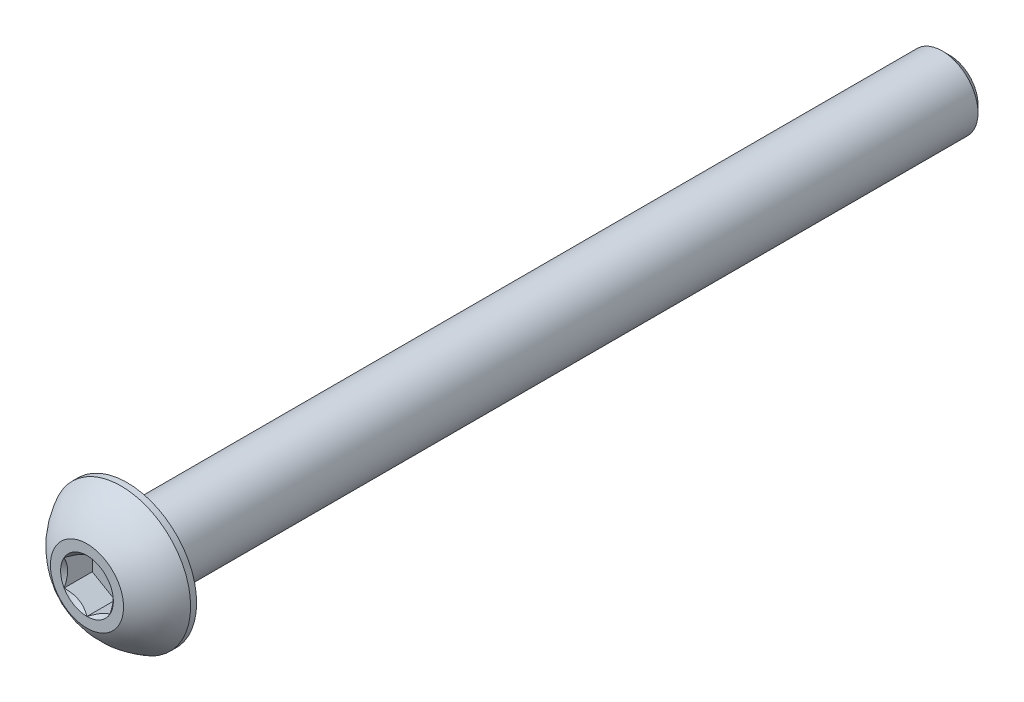
ISO-10303-21;
HEADER;
FILE_DESCRIPTION(('STEP AP214'),'2;1');
FILE_NAME('part.step','',(''),(''),'','','');
FILE_SCHEMA(('AUTOMOTIVE_DESIGN { 1 0 10303 214 1 1 1 1 }'));
ENDSEC;
DATA;
#1=APPLICATION_CONTEXT('core data for automotive mechanical design processes');
#2=APPLICATION_PROTOCOL_DEFINITION('international standard','automotive_design',2000,#1);
#3=PRODUCT_CONTEXT('',#1,'mechanical');
#4=PRODUCT('Part','Part','',(#3));
#5=PRODUCT_RELATED_PRODUCT_CATEGORY('part','',(#4));
#6=PRODUCT_DEFINITION_FORMATION('','',#4);
#7=PRODUCT_DEFINITION_CONTEXT('part definition',#1,'design');
#8=PRODUCT_DEFINITION('design','',#6,#7);
#9=PRODUCT_DEFINITION_SHAPE('','',#8);
#10=(LENGTH_UNIT() NAMED_UNIT(*) SI_UNIT(.MILLI.,.METRE.));
#11=(NAMED_UNIT(*) PLANE_ANGLE_UNIT() SI_UNIT($,.RADIAN.));
#12=(NAMED_UNIT(*) SI_UNIT($,.STERADIAN.) SOLID_ANGLE_UNIT());
#13=UNCERTAINTY_MEASURE_WITH_UNIT(LENGTH_MEASURE(1.E-05),#10,'distance_accuracy_value','');
#14=(GEOMETRIC_REPRESENTATION_CONTEXT(3) GLOBAL_UNCERTAINTY_ASSIGNED_CONTEXT((#13)) GLOBAL_UNIT_ASSIGNED_CONTEXT((#10,
#11,#12)) REPRESENTATION_CONTEXT('',''));
#15=CARTESIAN_POINT('',(0.,0.,0.));
#16=DIRECTION('',(0.,0.,1.));
#17=DIRECTION('',(1.,0.,0.));
#18=AXIS2_PLACEMENT_3D('',#15,#16,#17);
#19=CARTESIAN_POINT('',(1.25,-0.721687836487031,-1.54));
#20=DIRECTION('',(0.,0.,1.));
#21=DIRECTION('',(1.,0.,0.));
#22=AXIS2_PLACEMENT_3D('',#19,#20,#21);
#23=PLANE('',#22);
#24=DIRECTION('',(0.,1.,0.));
#25=VECTOR('',#24,1.);
#26=CARTESIAN_POINT('',(-1.25,0.721687836487033,-1.54));
#27=LINE('',#26,#25);
#28=CARTESIAN_POINT('',(-1.25,0.721687836487033,-1.54));
#29=VERTEX_POINT('',#28);
#30=CARTESIAN_POINT('',(-1.25,-0.721687836487033,-1.54));
#31=VERTEX_POINT('',#30);
#32=EDGE_CURVE('E67',#29,#31,#27,.F.);
#33=ORIENTED_EDGE('',*,*,#32,.T.);
#34=DIRECTION('',(0.866025403784439,-0.5,0.));
#35=VECTOR('',#34,1.);
#36=CARTESIAN_POINT('',(-1.25,-0.721687836487033,-1.54));
#37=LINE('',#36,#35);
#38=CARTESIAN_POINT('',(0.,-1.44337567297406,-1.54));
#39=VERTEX_POINT('',#38);
#40=EDGE_CURVE('E81',#31,#39,#37,.T.);
#41=ORIENTED_EDGE('',*,*,#40,.T.);
#42=DIRECTION('',(0.866025403784438,0.5,0.));
#43=VECTOR('',#42,1.);
#44=CARTESIAN_POINT('',(0.,-1.44337567297406,-1.54));
#45=LINE('',#44,#43);
#46=CARTESIAN_POINT('',(1.25,-0.721687836487033,-1.54));
#47=VERTEX_POINT('',#46);
#48=EDGE_CURVE('E84',#39,#47,#45,.T.);
#49=ORIENTED_EDGE('',*,*,#48,.T.);
#50=DIRECTION('',(0.,1.,0.));
#51=VECTOR('',#50,1.);
#52=CARTESIAN_POINT('',(1.25,-0.721687836487031,-1.54));
#53=LINE('',#52,#51);
#54=CARTESIAN_POINT('',(1.25,0.721687836487033,-1.54));
#55=VERTEX_POINT('',#54);
#56=EDGE_CURVE('E93',#47,#55,#53,.T.);
#57=ORIENTED_EDGE('',*,*,#56,.T.);
#58=DIRECTION('',(-0.866025403784439,0.5,0.));
#59=VECTOR('',#58,1.);
#60=CARTESIAN_POINT('',(1.25,0.721687836487033,-1.54));
#61=LINE('',#60,#59);
#62=CARTESIAN_POINT('',(0.,1.44337567297406,-1.54));
#63=VERTEX_POINT('',#62);
#64=EDGE_CURVE('E385',#55,#63,#61,.T.);
#65=ORIENTED_EDGE('',*,*,#64,.T.);
#66=DIRECTION('',(-0.866025403784438,-0.5,0.));
#67=VECTOR('',#66,1.);
#68=CARTESIAN_POINT('',(0.,1.44337567297406,-1.54));
#69=LINE('',#68,#67);
#70=EDGE_CURVE('E72',#63,#29,#69,.T.);
#71=ORIENTED_EDGE('',*,*,#70,.T.);
#72=EDGE_LOOP('',(#33,#41,#49,#57,#65,#71));
#73=FACE_BOUND('',#72,.T.);
#74=ADVANCED_FACE('F17',(#73),#23,.T.);
#75=CARTESIAN_POINT('',(-1.25,-0.721687836487033,-1.54));
#76=DIRECTION('',(-0.5,-0.866025403784439,0.));
#77=DIRECTION('',(0.866025403784439,-0.5,0.));
#78=AXIS2_PLACEMENT_3D('',#75,#76,#77);
#79=PLANE('',#78);
#80=CARTESIAN_POINT('',(-1.2500000000016,-0.721687836486112,-2.26854616907309E-12));
#81=CARTESIAN_POINT('',(-1.20703689150833,-0.746492598739921,-0.0247809602853261));
#82=CARTESIAN_POINT('',(-1.1633554359775,-0.771712098849239,-0.0481062505422109));
#83=CARTESIAN_POINT('',(-1.07428446548141,-0.823137247642138,-0.0908138610995846));
#84=CARTESIAN_POINT('',(-1.02888648449087,-0.849347784187693,-0.110172426663462));
#85=CARTESIAN_POINT('',(-0.937343688598987,-0.902200042038243,-0.143333784117164));
#86=CARTESIAN_POINT('',(-0.891222174228788,-0.92882831077531,-0.15721990325138));
#87=CARTESIAN_POINT('',(-0.79796403899848,-0.982670920254651,-0.178614098245694));
#88=CARTESIAN_POINT('',(-0.750830265050418,-1.00988361733149,-0.186138138130081));
#89=CARTESIAN_POINT('',(-0.669590913661114,-1.05678717872489,-0.192927172266351));
#90=CARTESIAN_POINT('',(-0.6355901781368,-1.0764175125325,-0.19393181141306));
#91=CARTESIAN_POINT('',(-0.567648554853577,-1.11564362702425,-0.192236504858619));
#92=CARTESIAN_POINT('',(-0.533707681972964,-1.1352393991184,-0.189535740825174));
#93=CARTESIAN_POINT('',(-0.466153619951156,-1.17424175501155,-0.180585751756811));
#94=CARTESIAN_POINT('',(-0.432540765124884,-1.19364814579373,-0.174333227052609));
#95=CARTESIAN_POINT('',(-0.365876261008733,-1.23213691519058,-0.158616460881213));
#96=CARTESIAN_POINT('',(-0.332824858931062,-1.25121915107722,-0.149150841277128));
#97=CARTESIAN_POINT('',(-0.24821357015969,-1.30006950142585,-0.121071668556235));
#98=CARTESIAN_POINT('',(-0.197186124607517,-1.32953021085146,-0.100350655055702));
#99=CARTESIAN_POINT('',(-0.0971276057052176,-1.38729902367441,-0.0536764942537948));
#100=CARTESIAN_POINT('',(-0.0480906425773463,-1.41561052753653,-0.0277403788128113));
#101=CARTESIAN_POINT('',(1.59588998096064E-12,-1.44337567297499,-2.26831546268589E-12));
#102=B_SPLINE_CURVE_WITH_KNOTS('',3,(#80,#81,#82,#83,#84,#85,#86,#87,#88,#89,#90,#91,#92,#93,
#94,#95,#96,#97,#98,#99,#100,#101),.UNSPECIFIED.,.F.,.F.,(4,2,2,2,2,2,2,2,2,2,4),(0.,
0.166478683193945,0.333926926769031,0.498716658424013,0.663091654503516,0.780745575390526,
0.898425484138539,1.01621489951224,1.13405490022132,1.32111591628309,1.5075756576265),.UNSPECIFIED.);
#103=CARTESIAN_POINT('',(-1.25000000000138,-0.721687836487831,-1.5951241137448E-12));
#104=VERTEX_POINT('',#103);
#105=CARTESIAN_POINT('',(-1.9643547074789E-12,-1.44337567297612,-1.13414006609939E-12));
#106=VERTEX_POINT('',#105);
#107=EDGE_CURVE('E20',#104,#106,#102,.T.);
#108=ORIENTED_EDGE('',*,*,#107,.T.);
#109=DIRECTION('',(0.,0.,1.));
#110=VECTOR('',#109,1.);
#111=CARTESIAN_POINT('',(0.,-1.44337567297406,-1.54));
#112=LINE('',#111,#110);
#113=EDGE_CURVE('E88',#106,#39,#112,.F.);
#114=ORIENTED_EDGE('',*,*,#113,.T.);
#115=ORIENTED_EDGE('',*,*,#40,.F.);
#116=DIRECTION('',(0.,0.,1.));
#117=VECTOR('',#116,1.);
#118=CARTESIAN_POINT('',(-1.25,-0.721687836487033,-1.54));
#119=LINE('',#118,#117);
#120=EDGE_CURVE('E59',#31,#104,#119,.T.);
#121=ORIENTED_EDGE('',*,*,#120,.T.);
#122=EDGE_LOOP('',(#108,#114,#115,#121));
#123=FACE_BOUND('',#122,.T.);
#124=ADVANCED_FACE('F89',(#123),#79,.F.);
#125=CARTESIAN_POINT('',(0.,-1.44337567297406,-1.54));
#126=DIRECTION('',(0.5,-0.866025403784438,0.));
#127=DIRECTION('',(0.866025403784438,0.5,0.));
#128=AXIS2_PLACEMENT_3D('',#125,#126,#127);
#129=PLANE('',#128);
#130=CARTESIAN_POINT('',(-1.59611293155492E-12,-1.44337567297499,-2.26829098732745E-12));
#131=CARTESIAN_POINT('',(0.0429631084916687,-1.41857091072118,-0.024780960285326));
#132=CARTESIAN_POINT('',(0.0866445640224965,-1.39335141061186,-0.0481062505422108));
#133=CARTESIAN_POINT('',(0.175715534518587,-1.34192626181896,-0.0908138610995848));
#134=CARTESIAN_POINT('',(0.22111351550913,-1.3157157252734,-0.110172426663462));
#135=CARTESIAN_POINT('',(0.312656311401013,-1.26286346742285,-0.143333784117164));
#136=CARTESIAN_POINT('',(0.358777825771212,-1.23623519868579,-0.15721990325138));
#137=CARTESIAN_POINT('',(0.45203596100152,-1.18239258920645,-0.178614098245695));
#138=CARTESIAN_POINT('',(0.499169734949581,-1.15517989212961,-0.186138138130082));
#139=CARTESIAN_POINT('',(0.580409086338886,-1.1082763307362,-0.192927172266352));
#140=CARTESIAN_POINT('',(0.614409821863201,-1.0886459969286,-0.19393181141306));
#141=CARTESIAN_POINT('',(0.682351445146424,-1.04941988243685,-0.192236504858619));
#142=CARTESIAN_POINT('',(0.716292318027036,-1.02982411034269,-0.189535740825175));
#143=CARTESIAN_POINT('',(0.783846380048844,-0.99082175444955,-0.180585751756811));
#144=CARTESIAN_POINT('',(0.817459234875116,-0.97141536366737,-0.174333227052609));
#145=CARTESIAN_POINT('',(0.884123738991267,-0.932926594270517,-0.158616460881214));
#146=CARTESIAN_POINT('',(0.917175141068938,-0.913844358383879,-0.149150841277129));
#147=CARTESIAN_POINT('',(1.00178642984031,-0.864994008035247,-0.121071668556236));
#148=CARTESIAN_POINT('',(1.05281387539248,-0.835533298609641,-0.100350655055702));
#149=CARTESIAN_POINT('',(1.15287239429478,-0.777764485786683,-0.0536764942537957));
#150=CARTESIAN_POINT('',(1.20190935742265,-0.749452981924565,-0.0277403788128123));
#151=CARTESIAN_POINT('',(1.25000000000159,-0.721687836486111,-2.26948430000091E-12));
#152=B_SPLINE_CURVE_WITH_KNOTS('',3,(#130,#131,#132,#133,#134,#135,#136,#137,#138,#139,#140,
#141,#142,#143,#144,#145,#146,#147,#148,#149,#150,#151),.UNSPECIFIED.,.F.,.F.,(4,2,2,2,2,2,2,2,
2,2,4),(0.,0.166478683193946,0.333926926769032,0.498716658424014,0.663091654503518,
0.780745575390527,0.898425484138541,1.01621489951224,1.13405490022132,1.3211159162831,
1.5075756576265),.UNSPECIFIED.);
#153=CARTESIAN_POINT('',(1.2500000000008,-0.721687836489762,-1.13472044677118E-12));
#154=VERTEX_POINT('',#153);
#155=EDGE_CURVE('E202',#106,#154,#152,.T.);
#156=ORIENTED_EDGE('',*,*,#155,.T.);
#157=DIRECTION('',(0.,0.,-1.));
#158=VECTOR('',#157,1.);
#159=CARTESIAN_POINT('',(1.25,-0.721687836487033,-1.54));
#160=LINE('',#159,#158);
#161=EDGE_CURVE('E97',#154,#47,#160,.T.);
#162=ORIENTED_EDGE('',*,*,#161,.T.);
#163=ORIENTED_EDGE('',*,*,#48,.F.);
#164=ORIENTED_EDGE('',*,*,#113,.F.);
#165=EDGE_LOOP('',(#156,#162,#163,#164));
#166=FACE_BOUND('',#165,.T.);
#167=ADVANCED_FACE('F95',(#166),#129,.F.);
#168=CARTESIAN_POINT('',(1.25,-0.721687836487031,-1.54));
#169=DIRECTION('',(1.,0.,0.));
#170=DIRECTION('',(0.,0.,-1.));
#171=AXIS2_PLACEMENT_3D('',#168,#169,#170);
#172=PLANE('',#171);
#173=CARTESIAN_POINT('',(1.25,-0.721687836488877,-2.26858313223581E-12));
#174=CARTESIAN_POINT('',(1.25,-0.672078311968736,-0.0247809602843532));
#175=CARTESIAN_POINT('',(1.25,-0.621639311737502,-0.0481062505397492));
#176=CARTESIAN_POINT('',(1.25,-0.518789014126519,-0.090813861092758));
#177=CARTESIAN_POINT('',(1.25,-0.466367941022825,-0.110172426653756));
#178=CARTESIAN_POINT('',(1.25,-0.360663425297222,-0.143333784099998));
#179=CARTESIAN_POINT('',(1.25,-0.307406887811172,-0.157219903229684));
#180=CARTESIAN_POINT('',(1.25,-0.199721668829271,-0.178614098213363));
#181=CARTESIAN_POINT('',(1.25,-0.145296274664292,-0.186138138091648));
#182=CARTESIAN_POINT('',(1.25,-0.0514891518512716,-0.19292717221706));
#183=CARTESIAN_POINT('',(1.25,-0.0122284842208857,-0.193931811358573));
#184=CARTESIAN_POINT('',(1.25,0.0662237447923829,-0.192236504792063));
#185=CARTESIAN_POINT('',(1.25,0.105415288995289,-0.189535740751744));
#186=CARTESIAN_POINT('',(1.25,0.183420000810114,-0.180585751668418));
#187=CARTESIAN_POINT('',(1.25,0.22223278238841,-0.174333226956127));
#188=CARTESIAN_POINT('',(1.25,0.29921032120936,-0.158616460767835));
#189=CARTESIAN_POINT('',(1.25,0.337374792995945,-0.149150841154943));
#190=CARTESIAN_POINT('',(1.25,0.43507549364919,-0.121071668433229));
#191=CARTESIAN_POINT('',(1.25,0.493996912445358,-0.100350654949519));
#192=CARTESIAN_POINT('',(1.25,0.609534537985815,-0.0536764941931699));
#193=CARTESIAN_POINT('',(1.25,0.666157545659632,-0.0277403787809149));
#194=CARTESIAN_POINT('',(1.25,0.721687836488877,-2.26871804132705E-12));
#195=B_SPLINE_CURVE_WITH_KNOTS('',3,(#173,#174,#175,#176,#177,#178,#179,#180,#181,#182,#183,
#184,#185,#186,#187,#188,#189,#190,#191,#192,#193,#194),.UNSPECIFIED.,.F.,.F.,(4,2,2,2,2,2,2,2,
2,2,4),(0.,0.166478683226287,0.333926926833724,0.498716658519757,0.663091654630287,
0.780745575562286,0.898425484355342,1.01621489977414,1.13405490052834,1.3211159164188,
1.50757565759032),.UNSPECIFIED.);
#196=CARTESIAN_POINT('',(1.25000000000276,0.72168783648636,-1.13429954077611E-12));
#197=VERTEX_POINT('',#196);
#198=EDGE_CURVE('E184',#154,#197,#195,.T.);
#199=ORIENTED_EDGE('',*,*,#198,.T.);
#200=DIRECTION('',(0.,0.,1.));
#201=VECTOR('',#200,1.);
#202=CARTESIAN_POINT('',(1.25,0.721687836487033,-1.54));
#203=LINE('',#202,#201);
#204=EDGE_CURVE('E378',#197,#55,#203,.F.);
#205=ORIENTED_EDGE('',*,*,#204,.T.);
#206=ORIENTED_EDGE('',*,*,#56,.F.);
#207=ORIENTED_EDGE('',*,*,#161,.F.);
#208=EDGE_LOOP('',(#199,#205,#206,#207));
#209=FACE_BOUND('',#208,.T.);
#210=ADVANCED_FACE('F174',(#209),#172,.F.);
#211=CARTESIAN_POINT('',(1.25,0.721687836487033,-1.54));
#212=DIRECTION('',(0.5,0.866025403784439,0.));
#213=DIRECTION('',(-0.866025403784439,0.5,0.));
#214=AXIS2_PLACEMENT_3D('',#211,#212,#213);
#215=PLANE('',#214);
#216=CARTESIAN_POINT('',(1.25000000000159,0.721687836486112,-2.26868023951624E-12));
#217=CARTESIAN_POINT('',(1.20703689150833,0.746492598739921,-0.0247809602853261));
#218=CARTESIAN_POINT('',(1.1633554359775,0.771712098849239,-0.0481062505422109));
#219=CARTESIAN_POINT('',(1.07428446548141,0.823137247642138,-0.090813861099585));
#220=CARTESIAN_POINT('',(1.02888648449087,0.849347784187694,-0.110172426663463));
#221=CARTESIAN_POINT('',(0.937343688598987,0.902200042038243,-0.143333784117165));
#222=CARTESIAN_POINT('',(0.891222174228787,0.928828310775311,-0.15721990325138));
#223=CARTESIAN_POINT('',(0.797964038998479,0.982670920254652,-0.178614098245694));
#224=CARTESIAN_POINT('',(0.750830265050418,1.00988361733149,-0.186138138130082));
#225=CARTESIAN_POINT('',(0.669590913661113,1.05678717872489,-0.192927172266351));
#226=CARTESIAN_POINT('',(0.635590178136799,1.0764175125325,-0.19393181141306));
#227=CARTESIAN_POINT('',(0.567648554853576,1.11564362702425,-0.192236504858619));
#228=CARTESIAN_POINT('',(0.533707681972963,1.1352393991184,-0.189535740825174));
#229=CARTESIAN_POINT('',(0.466153619951155,1.17424175501155,-0.180585751756811));
#230=CARTESIAN_POINT('',(0.432540765124883,1.19364814579373,-0.174333227052609));
#231=CARTESIAN_POINT('',(0.365876261008732,1.23213691519058,-0.158616460881213));
#232=CARTESIAN_POINT('',(0.332824858931061,1.25121915107722,-0.149150841277128));
#233=CARTESIAN_POINT('',(0.248213570159689,1.30006950142585,-0.121071668556235));
#234=CARTESIAN_POINT('',(0.197186124607516,1.32953021085146,-0.100350655055701));
#235=CARTESIAN_POINT('',(0.0971276057052171,1.38729902367441,-0.0536764942537947));
#236=CARTESIAN_POINT('',(0.0480906425773458,1.41561052753653,-0.0277403788128112));
#237=CARTESIAN_POINT('',(-1.59632564716783E-12,1.44337567297499,-2.26807308684283E-12));
#238=B_SPLINE_CURVE_WITH_KNOTS('',3,(#216,#217,#218,#219,#220,#221,#222,#223,#224,#225,#226,
#227,#228,#229,#230,#231,#232,#233,#234,#235,#236,#237),.UNSPECIFIED.,.F.,.F.,(4,2,2,2,2,2,2,2,
2,2,4),(0.,0.166478683193945,0.333926926769031,0.498716658424013,0.663091654503517,
0.780745575390526,0.898425484138539,1.01621489951224,1.13405490022132,1.32111591628309,
1.5075756576265),.UNSPECIFIED.);
#239=CARTESIAN_POINT('',(1.96414111343126E-12,1.44337567297612,-1.13402132559796E-12));
#240=VERTEX_POINT('',#239);
#241=EDGE_CURVE('E178',#197,#240,#238,.T.);
#242=ORIENTED_EDGE('',*,*,#241,.T.);
#243=DIRECTION('',(0.,0.,1.));
#244=VECTOR('',#243,1.);
#245=CARTESIAN_POINT('',(0.,1.44337567297406,-1.54));
#246=LINE('',#245,#244);
#247=EDGE_CURVE('E413',#240,#63,#246,.F.);
#248=ORIENTED_EDGE('',*,*,#247,.T.);
#249=ORIENTED_EDGE('',*,*,#64,.F.);
#250=ORIENTED_EDGE('',*,*,#204,.F.);
#251=EDGE_LOOP('',(#242,#248,#249,#250));
#252=FACE_BOUND('',#251,.T.);
#253=ADVANCED_FACE('F170',(#252),#215,.F.);
#254=CARTESIAN_POINT('',(0.,1.44337567297406,-1.54));
#255=DIRECTION('',(-0.5,0.866025403784438,0.));
#256=DIRECTION('',(-0.866025403784438,-0.5,0.));
#257=AXIS2_PLACEMENT_3D('',#254,#255,#256);
#258=PLANE('',#257);
#259=CARTESIAN_POINT('',(1.59579801779913E-12,1.44337567297499,-2.26839609262175E-12));
#260=CARTESIAN_POINT('',(-0.0429631084916691,1.41857091072118,-0.0247809602853258));
#261=CARTESIAN_POINT('',(-0.0866445640224969,1.39335141061186,-0.0481062505422107));
#262=CARTESIAN_POINT('',(-0.175715534518588,1.34192626181896,-0.0908138610995848));
#263=CARTESIAN_POINT('',(-0.22111351550913,1.3157157252734,-0.110172426663463));
#264=CARTESIAN_POINT('',(-0.312656311401013,1.26286346742285,-0.143333784117165));
#265=CARTESIAN_POINT('',(-0.358777825771212,1.23623519868579,-0.15721990325138));
#266=CARTESIAN_POINT('',(-0.45203596100152,1.18239258920645,-0.178614098245694));
#267=CARTESIAN_POINT('',(-0.499169734949582,1.15517989212961,-0.186138138130082));
#268=CARTESIAN_POINT('',(-0.580409086338887,1.1082763307362,-0.192927172266352));
#269=CARTESIAN_POINT('',(-0.614409821863201,1.08864599692859,-0.19393181141306));
#270=CARTESIAN_POINT('',(-0.682351445146424,1.04941988243685,-0.192236504858619));
#271=CARTESIAN_POINT('',(-0.716292318027036,1.02982411034269,-0.189535740825175));
#272=CARTESIAN_POINT('',(-0.783846380048845,0.99082175444955,-0.180585751756811));
#273=CARTESIAN_POINT('',(-0.817459234875117,0.97141536366737,-0.174333227052609));
#274=CARTESIAN_POINT('',(-0.884123738991267,0.932926594270517,-0.158616460881214));
#275=CARTESIAN_POINT('',(-0.917175141068938,0.913844358383879,-0.149150841277128));
#276=CARTESIAN_POINT('',(-1.00178642984031,0.864994008035247,-0.121071668556235));
#277=CARTESIAN_POINT('',(-1.05281387539248,0.835533298609641,-0.100350655055702));
#278=CARTESIAN_POINT('',(-1.15287239429478,0.777764485786683,-0.0536764942537954));
#279=CARTESIAN_POINT('',(-1.20190935742265,0.749452981924565,-0.0277403788128121));
#280=CARTESIAN_POINT('',(-1.25000000000159,0.721687836486111,-2.26930309879084E-12));
#281=B_SPLINE_CURVE_WITH_KNOTS('',3,(#259,#260,#261,#262,#263,#264,#265,#266,#267,#268,#269,
#270,#271,#272,#273,#274,#275,#276,#277,#278,#279,#280),.UNSPECIFIED.,.F.,.F.,(4,2,2,2,2,2,2,2,
2,2,4),(0.,0.166478683193945,0.333926926769032,0.498716658424014,0.663091654503518,
0.780745575390528,0.898425484138541,1.01621489951224,1.13405490022132,1.3211159162831,
1.5075756576265),.UNSPECIFIED.);
#282=CARTESIAN_POINT('',(-1.2500000000008,0.721687836489762,-1.13467797617798E-12));
#283=VERTEX_POINT('',#282);
#284=EDGE_CURVE('E40',#240,#283,#281,.T.);
#285=ORIENTED_EDGE('',*,*,#284,.T.);
#286=DIRECTION('',(0.,0.,1.));
#287=VECTOR('',#286,1.);
#288=CARTESIAN_POINT('',(-1.25,0.721687836487033,-1.54));
#289=LINE('',#288,#287);
#290=EDGE_CURVE('E403',#283,#29,#289,.F.);
#291=ORIENTED_EDGE('',*,*,#290,.T.);
#292=ORIENTED_EDGE('',*,*,#70,.F.);
#293=ORIENTED_EDGE('',*,*,#247,.F.);
#294=EDGE_LOOP('',(#285,#291,#292,#293));
#295=FACE_BOUND('',#294,.T.);
#296=ADVANCED_FACE('F163',(#295),#258,.F.);
#297=CARTESIAN_POINT('',(-1.25,0.721687836487033,-1.54));
#298=DIRECTION('',(-1.,0.,0.));
#299=DIRECTION('',(0.,0.,1.));
#300=AXIS2_PLACEMENT_3D('',#297,#298,#299);
#301=PLANE('',#300);
#302=CARTESIAN_POINT('',(-1.25,0.721687836488877,-2.26875901392157E-12));
#303=CARTESIAN_POINT('',(-1.25,0.672078311968735,-0.0247809602843534));
#304=CARTESIAN_POINT('',(-1.25,0.621639311737502,-0.0481062505397494));
#305=CARTESIAN_POINT('',(-1.25,0.518789014126519,-0.0908138610927582));
#306=CARTESIAN_POINT('',(-1.25,0.466367941022824,-0.110172426653756));
#307=CARTESIAN_POINT('',(-1.25,0.360663425297222,-0.143333784099998));
#308=CARTESIAN_POINT('',(-1.25,0.307406887811172,-0.157219903229684));
#309=CARTESIAN_POINT('',(-1.25,0.199721668829271,-0.178614098213363));
#310=CARTESIAN_POINT('',(-1.25,0.145296274664291,-0.186138138091648));
#311=CARTESIAN_POINT('',(-1.25,0.0514891518512711,-0.192927172217061));
#312=CARTESIAN_POINT('',(-1.25,0.0122284842208852,-0.193931811358573));
#313=CARTESIAN_POINT('',(-1.25,-0.0662237447923835,-0.192236504792062));
#314=CARTESIAN_POINT('',(-1.25,-0.10541528899529,-0.189535740751744));
#315=CARTESIAN_POINT('',(-1.25,-0.183420000810114,-0.180585751668418));
#316=CARTESIAN_POINT('',(-1.25,-0.22223278238841,-0.174333226956126));
#317=CARTESIAN_POINT('',(-1.25,-0.29921032120936,-0.158616460767835));
#318=CARTESIAN_POINT('',(-1.25,-0.337374792995945,-0.149150841154943));
#319=CARTESIAN_POINT('',(-1.25,-0.43507549364919,-0.121071668433229));
#320=CARTESIAN_POINT('',(-1.25,-0.493996912445359,-0.100350654949519));
#321=CARTESIAN_POINT('',(-1.25,-0.609534537985815,-0.0536764941931698));
#322=CARTESIAN_POINT('',(-1.25,-0.666157545659632,-0.0277403787809148));
#323=CARTESIAN_POINT('',(-1.25,-0.721687836488877,-2.26872114510822E-12));
#324=B_SPLINE_CURVE_WITH_KNOTS('',3,(#302,#303,#304,#305,#306,#307,#308,#309,#310,#311,#312,
#313,#314,#315,#316,#317,#318,#319,#320,#321,#322,#323),.UNSPECIFIED.,.F.,.F.,(4,2,2,2,2,2,2,2,
2,2,4),(0.,0.166478683226287,0.333926926833725,0.498716658519757,0.663091654630287,
0.780745575562286,0.898425484355342,1.01621489977414,1.13405490052834,1.3211159164188,
1.50757565759032),.UNSPECIFIED.);
#325=EDGE_CURVE('E143',#283,#104,#324,.T.);
#326=ORIENTED_EDGE('',*,*,#325,.T.);
#327=ORIENTED_EDGE('',*,*,#120,.F.);
#328=ORIENTED_EDGE('',*,*,#32,.F.);
#329=ORIENTED_EDGE('',*,*,#290,.F.);
#330=EDGE_LOOP('',(#326,#327,#328,#329));
#331=FACE_BOUND('',#330,.T.);
#332=ADVANCED_FACE('F159',(#331),#301,.F.);
#333=CARTESIAN_POINT('',(0.,0.,-5.6843418860808E-11));
#334=DIRECTION('',(0.,0.,1.));
#335=DIRECTION('',(1.,0.,0.));
#336=AXIS2_PLACEMENT_3D('',#333,#334,#335);
#337=CONICAL_SURFACE('',#336,1.44337567292041,0.78539816325135);
#338=ORIENTED_EDGE('',*,*,#107,.F.);
#339=CARTESIAN_POINT('',(0.,0.,0.));
#340=DIRECTION('',(0.,0.,1.));
#341=DIRECTION('',(1.,0.,0.));
#342=AXIS2_PLACEMENT_3D('',#339,#340,#341);
#343=CIRCLE('',#342,1.44337567297725);
#344=EDGE_CURVE('E151',#104,#106,#343,.T.);
#345=ORIENTED_EDGE('',*,*,#344,.T.);
#346=EDGE_LOOP('',(#338,#345));
#347=FACE_BOUND('',#346,.T.);
#348=ADVANCED_FACE('F162',(#347),#337,.F.);
#349=CARTESIAN_POINT('',(0.,0.,-5.6843418860808E-11));
#350=DIRECTION('',(0.,0.,1.));
#351=DIRECTION('',(1.,0.,0.));
#352=AXIS2_PLACEMENT_3D('',#349,#350,#351);
#353=CONICAL_SURFACE('',#352,1.44337567292041,0.78539816325135);
#354=ORIENTED_EDGE('',*,*,#155,.F.);
#355=CARTESIAN_POINT('',(0.,0.,0.));
#356=DIRECTION('',(0.,0.,1.));
#357=DIRECTION('',(1.,0.,0.));
#358=AXIS2_PLACEMENT_3D('',#355,#356,#357);
#359=CIRCLE('',#358,1.44337567297725);
#360=EDGE_CURVE('E391',#106,#154,#359,.T.);
#361=ORIENTED_EDGE('',*,*,#360,.T.);
#362=EDGE_LOOP('',(#354,#361));
#363=FACE_BOUND('',#362,.T.);
#364=ADVANCED_FACE('F197',(#363),#353,.F.);
#365=CARTESIAN_POINT('',(0.,0.,-5.6843418860808E-11));
#366=DIRECTION('',(0.,0.,1.));
#367=DIRECTION('',(1.,0.,0.));
#368=AXIS2_PLACEMENT_3D('',#365,#366,#367);
#369=CONICAL_SURFACE('',#368,1.44337567292041,0.785398163397448);
#370=CARTESIAN_POINT('',(0.,0.,0.));
#371=DIRECTION('',(0.,0.,1.));
#372=DIRECTION('',(1.,0.,0.));
#373=AXIS2_PLACEMENT_3D('',#370,#371,#372);
#374=CIRCLE('',#373,1.44337567297725);
#375=EDGE_CURVE('E387',#154,#197,#374,.T.);
#376=ORIENTED_EDGE('',*,*,#375,.T.);
#377=ORIENTED_EDGE('',*,*,#198,.F.);
#378=EDGE_LOOP('',(#376,#377));
#379=FACE_BOUND('',#378,.T.);
#380=ADVANCED_FACE('F193',(#379),#369,.F.);
#381=CARTESIAN_POINT('',(0.,0.,-5.6843418860808E-11));
#382=DIRECTION('',(0.,0.,1.));
#383=DIRECTION('',(1.,0.,0.));
#384=AXIS2_PLACEMENT_3D('',#381,#382,#383);
#385=CONICAL_SURFACE('',#384,1.44337567292041,0.78539816325135);
#386=ORIENTED_EDGE('',*,*,#241,.F.);
#387=CARTESIAN_POINT('',(0.,0.,0.));
#388=DIRECTION('',(0.,0.,1.));
#389=DIRECTION('',(1.,0.,0.));
#390=AXIS2_PLACEMENT_3D('',#387,#388,#389);
#391=CIRCLE('',#390,1.44337567297725);
#392=EDGE_CURVE('E390',#197,#240,#391,.T.);
#393=ORIENTED_EDGE('',*,*,#392,.T.);
#394=EDGE_LOOP('',(#386,#393));
#395=FACE_BOUND('',#394,.T.);
#396=ADVANCED_FACE('F190',(#395),#385,.F.);
#397=CARTESIAN_POINT('',(0.,0.,-5.6843418860808E-11));
#398=DIRECTION('',(0.,0.,1.));
#399=DIRECTION('',(1.,0.,0.));
#400=AXIS2_PLACEMENT_3D('',#397,#398,#399);
#401=CONICAL_SURFACE('',#400,1.44337567292041,0.78539816325135);
#402=ORIENTED_EDGE('',*,*,#284,.F.);
#403=CARTESIAN_POINT('',(0.,0.,0.));
#404=DIRECTION('',(0.,0.,1.));
#405=DIRECTION('',(1.,0.,0.));
#406=AXIS2_PLACEMENT_3D('',#403,#404,#405);
#407=CIRCLE('',#406,1.44337567297725);
#408=EDGE_CURVE('E397',#240,#283,#407,.T.);
#409=ORIENTED_EDGE('',*,*,#408,.T.);
#410=EDGE_LOOP('',(#402,#409));
#411=FACE_BOUND('',#410,.T.);
#412=ADVANCED_FACE('F138',(#411),#401,.F.);
#413=CARTESIAN_POINT('',(0.,0.,-5.6843418860808E-11));
#414=DIRECTION('',(0.,0.,1.));
#415=DIRECTION('',(1.,0.,0.));
#416=AXIS2_PLACEMENT_3D('',#413,#414,#415);
#417=CONICAL_SURFACE('',#416,1.44337567292041,0.785398163397448);
#418=ORIENTED_EDGE('',*,*,#325,.F.);
#419=CARTESIAN_POINT('',(0.,0.,0.));
#420=DIRECTION('',(0.,0.,1.));
#421=DIRECTION('',(1.,0.,0.));
#422=AXIS2_PLACEMENT_3D('',#419,#420,#421);
#423=CIRCLE('',#422,1.44337567297725);
#424=EDGE_CURVE('E123',#283,#104,#423,.T.);
#425=ORIENTED_EDGE('',*,*,#424,.T.);
#426=EDGE_LOOP('',(#418,#425));
#427=FACE_BOUND('',#426,.T.);
#428=ADVANCED_FACE('F133',(#427),#417,.F.);
#429=CARTESIAN_POINT('',(0.,-2.,0.));
#430=DIRECTION('',(0.,0.,-1.));
#431=DIRECTION('',(-1.,0.,0.));
#432=AXIS2_PLACEMENT_3D('',#429,#430,#431);
#433=PLANE('',#432);
#434=ORIENTED_EDGE('',*,*,#408,.F.);
#435=ORIENTED_EDGE('',*,*,#392,.F.);
#436=ORIENTED_EDGE('',*,*,#375,.F.);
#437=ORIENTED_EDGE('',*,*,#360,.F.);
#438=ORIENTED_EDGE('',*,*,#344,.F.);
#439=ORIENTED_EDGE('',*,*,#424,.F.);
#440=EDGE_LOOP('',(#434,#435,#436,#437,#438,#439));
#441=FACE_BOUND('',#440,.T.);
#442=CARTESIAN_POINT('',(0.,2.00000000000003,0.));
#443=CARTESIAN_POINT('',(-0.112340883932912,1.99999501830894,0.));
#444=CARTESIAN_POINT('',(-0.224763225593511,1.99050288387286,2.67786643744105E-13));
#445=CARTESIAN_POINT('',(-0.446511726793884,1.95276859922381,-2.68543076346947E-13));
#446=CARTESIAN_POINT('',(-0.555833994612163,1.92450388247341,-1.01747290029802E-12));
#447=CARTESIAN_POINT('',(-0.768137698049019,1.85002906418696,-9.04627644213959E-13));
#448=CARTESIAN_POINT('',(-0.871122134819581,1.80382753320625,0.));
#449=CARTESIAN_POINT('',(-1.06784380972382,1.69480235085557,0.));
#450=CARTESIAN_POINT('',(-1.16158333928641,1.63198283268137,-7.30626007281602E-13));
#451=CARTESIAN_POINT('',(-1.33719709830383,1.49149220719559,-8.68796266313718E-13));
#452=CARTESIAN_POINT('',(-1.4190700851378,1.41381954648976,-2.33016417267554E-13));
#453=CARTESIAN_POINT('',(-1.56861687177601,1.24582829627509,2.32591876319973E-13));
#454=CARTESIAN_POINT('',(-1.63629011398115,1.15550921039541,0.));
#455=CARTESIAN_POINT('',(-1.75551140838453,0.964793228617706,0.));
#456=CARTESIAN_POINT('',(-1.80705976087959,0.864396520443123,0.));
#457=CARTESIAN_POINT('',(-1.89256952340776,0.656374060165251,0.));
#458=CARTESIAN_POINT('',(-1.92653096880464,0.548748322598588,0.));
#459=CARTESIAN_POINT('',(-1.97590307610692,0.329322588612884,0.));
#460=CARTESIAN_POINT('',(-1.99131370264779,0.217522584236606,0.));
#461=CARTESIAN_POINT('',(-2.00314657525842,-0.00707760750866588,0.));
#462=CARTESIAN_POINT('',(-1.9995688555433,-0.119877793075068,0.));
#463=CARTESIAN_POINT('',(-1.97352667238585,-0.343276528884571,0.));
#464=CARTESIAN_POINT('',(-1.951062201896,-0.453875078306125,0.));
#465=CARTESIAN_POINT('',(-1.88788417341464,-0.66973104818561,0.));
#466=CARTESIAN_POINT('',(-1.84717059615924,-0.774988463005274,0.));
#467=CARTESIAN_POINT('',(-1.74865010522098,-0.97717405329449,0.));
#468=CARTESIAN_POINT('',(-1.69084319710066,-1.07410223147454,0.));
#469=CARTESIAN_POINT('',(-1.55977703496568,-1.25687784284644,0.));
#470=CARTESIAN_POINT('',(-1.48651778720563,-1.34272528052339,0.));
#471=CARTESIAN_POINT('',(-1.32662653450798,-1.50090251249224,0.));
#472=CARTESIAN_POINT('',(-1.23999452773777,-1.57323230493167,0.));
#473=CARTESIAN_POINT('',(-1.05581697990551,-1.70232101036838,0.));
#474=CARTESIAN_POINT('',(-0.958271437417266,-1.75907992133083,0.));
#475=CARTESIAN_POINT('',(-0.755035863250462,-1.85541563039962,0.));
#476=CARTESIAN_POINT('',(-0.649345831920623,-1.89499242924164,0.));
#477=CARTESIAN_POINT('',(-0.432821510670029,-1.95584044724505,0.));
#478=CARTESIAN_POINT('',(-0.321987220981026,-1.97711166723113,0.));
#479=CARTESIAN_POINT('',(-0.0983206380605815,-2.000744703181,0.));
#480=CARTESIAN_POINT('',(0.0145116551708587,-2.00310651914481,2.77400188876239E-13));
#481=CARTESIAN_POINT('',(0.238971273328264,-1.98885370171912,-2.77833882252049E-13));
#482=CARTESIAN_POINT('',(0.350598598199945,-1.9722390674747,-1.03613454444918E-12));
#483=CARTESIAN_POINT('',(0.569479507471842,-1.92050498775072,-9.10225192901255E-13));
#484=CARTESIAN_POINT('',(0.676733091684786,-1.88538554147883,0.));
#485=CARTESIAN_POINT('',(0.883821886677256,-1.79763878093746,0.));
#486=CARTESIAN_POINT('',(0.983657098426234,-1.74501146895597,-8.07031901708265E-13));
#487=CARTESIAN_POINT('',(1.17307512321431,-1.6237429186722,-9.46773522929174E-13));
#488=CARTESIAN_POINT('',(1.26265793765839,-1.55510168256446,-2.53902026906535E-13));
#489=CARTESIAN_POINT('',(1.42902822576514,-1.40375377143034,2.5346844872083E-13));
#490=CARTESIAN_POINT('',(1.50581569424866,-1.32104709071074,0.));
#491=CARTESIAN_POINT('',(1.6444154975537,-1.143916081062,0.));
#492=CARTESIAN_POINT('',(1.706227827502,-1.04949174831972,0.));
#493=CARTESIAN_POINT('',(1.81312259248707,-0.851605992808604,0.));
#494=CARTESIAN_POINT('',(1.85820504518398,-0.748144579579494,0.));
#495=CARTESIAN_POINT('',(1.930360377799,-0.535121579788187,0.));
#496=CARTESIAN_POINT('',(1.95743326443731,-0.425559995502262,0.));
#497=CARTESIAN_POINT('',(1.99280100395237,-0.203446542492708,0.));
#498=CARTESIAN_POINT('',(2.00109582299283,-0.090894668381231,0.));
#499=CARTESIAN_POINT('',(1.99867186914421,0.134003935799385,0.));
#500=CARTESIAN_POINT('',(1.98795313250174,0.246350666259192,0.));
#501=CARTESIAN_POINT('',(1.94780635101614,0.467650235630708,0.));
#502=CARTESIAN_POINT('',(1.91837826855215,0.576603067717487,0.));
#503=CARTESIAN_POINT('',(1.84164749436853,0.788023717224053,0.));
#504=CARTESIAN_POINT('',(1.79434446975092,0.890491413824979,0.));
#505=CARTESIAN_POINT('',(1.68320860722376,1.08602688785114,0.));
#506=CARTESIAN_POINT('',(1.61937641833702,1.17909503415326,0.));
#507=CARTESIAN_POINT('',(1.47700183277598,1.35318491206689,0.));
#508=CARTESIAN_POINT('',(1.39846097592722,1.43420790307404,0.));
#509=CARTESIAN_POINT('',(1.22886860673972,1.58193852304533,0.));
#510=CARTESIAN_POINT('',(1.13781398977336,1.64864258897125,0.));
#511=CARTESIAN_POINT('',(0.94576298052538,1.76584229417068,0.));
#512=CARTESIAN_POINT('',(0.844761862199256,1.8163301793591,0.));
#513=CARTESIAN_POINT('',(0.635796194547823,1.89957454112384,0.));
#514=CARTESIAN_POINT('',(0.527840167198481,1.93235227258276,0.));
#515=CARTESIAN_POINT('',(0.349330109791198,1.97050988941561,0.));
#516=CARTESIAN_POINT('',(0.279935998206571,1.98155487929513,0.));
#517=CARTESIAN_POINT('',(0.140371860834155,1.99630149111709,0.));
#518=CARTESIAN_POINT('',(0.0702018350463667,2.00000311305953,0.));
#519=CARTESIAN_POINT('',(0.,2.00000000000003,0.));
#520=B_SPLINE_CURVE_WITH_KNOTS('',3,(#442,#443,#444,#445,#446,#447,#448,#449,#450,#451,#452,
#453,#454,#455,#456,#457,#458,#459,#460,#461,#462,#463,#464,#465,#466,#467,#468,#469,#470,#471,
#472,#473,#474,#475,#476,#477,#478,#479,#480,#481,#482,#483,#484,#485,#486,#487,#488,#489,#490,
#491,#492,#493,#494,#495,#496,#497,#498,#499,#500,#501,#502,#503,#504,#505,#506,#507,#508,#509,
#510,#511,#512,#513,#514,#515,#516,#517,#518,#519),.UNSPECIFIED.,.T.,.F.,(4,2,2,2,2,2,2,2,2,2,2,
2,2,2,2,2,2,2,2,2,2,2,2,2,2,2,2,2,2,2,2,2,2,2,2,2,2,2,4),(0.,0.336766415247735,
0.673938392179699,1.010949459739,1.34787678519447,1.68483936699332,2.02181517824713,
2.3587847135639,2.6957535712997,3.03272307141858,3.36969196435227,3.70666098302475,
4.04363035740484,4.38059962212801,4.71756875045742,5.05453792496562,5.39150714350999,
5.72847634762661,6.06544553656256,6.40241472549823,6.73938392961457,7.07635314815898,
7.41332232266721,7.75029145099711,8.08726071572086,8.424230090101,8.76119910877343,
9.09816800170707,9.435137501826,9.77210635956183,10.1090758948786,10.4460517061319,
10.7830142879302,11.119941613386,11.4569526809456,11.794124657878,12.130891073126,
12.3413364560064,12.5517818388868),.UNSPECIFIED.);
#521=CARTESIAN_POINT('',(0.,2.00000000000003,0.));
#522=VERTEX_POINT('',#521);
#523=EDGE_CURVE('E115',#522,#522,#520,.F.);
#524=ORIENTED_EDGE('',*,*,#523,.F.);
#525=EDGE_LOOP('',(#524));
#526=FACE_BOUND('',#525,.T.);
#527=ADVANCED_FACE('F129',(#441,#526),#433,.F.);
#528=CARTESIAN_POINT('',(0.,0.,-3.72644385026737));
#529=DIRECTION('',(0.,-1.,0.));
#530=DIRECTION('',(0.,0.,-1.));
#531=AXIS2_PLACEMENT_3D('',#528,#529,#530);
#532=SPHERICAL_SURFACE('',#531,4.22922968981298);
#533=ORIENTED_EDGE('',*,*,#523,.T.);
#534=EDGE_LOOP('',(#533));
#535=FACE_BOUND('',#534,.T.);
#536=CARTESIAN_POINT('',(0.,0.,-1.87));
#537=DIRECTION('',(0.,0.,1.));
#538=DIRECTION('',(1.,0.,0.));
#539=AXIS2_PLACEMENT_3D('',#536,#537,#538);
#540=CIRCLE('',#539,3.79999999999999);
#541=CARTESIAN_POINT('',(3.79999999999999,0.,-1.87));
#542=VERTEX_POINT('',#541);
#543=EDGE_CURVE('E112',#542,#542,#540,.F.);
#544=ORIENTED_EDGE('',*,*,#543,.F.);
#545=EDGE_LOOP('',(#544));
#546=FACE_BOUND('',#545,.T.);
#547=ADVANCED_FACE('F125',(#535,#546),#532,.T.);
#548=CARTESIAN_POINT('',(0.,-2.,-47.1999999999999));
#549=DIRECTION('',(0.,0.,-1.));
#550=DIRECTION('',(0.,1.,0.));
#551=AXIS2_PLACEMENT_3D('',#548,#549,#550);
#552=PLANE('',#551);
#553=CARTESIAN_POINT('',(0.,0.,-47.2000000000321));
#554=DIRECTION('',(0.,0.,1.));
#555=DIRECTION('',(1.,0.,0.));
#556=AXIS2_PLACEMENT_3D('',#553,#554,#555);
#557=CIRCLE('',#556,1.54999999995198);
#558=CARTESIAN_POINT('',(1.54999999995198,0.,-47.2000000000321));
#559=VERTEX_POINT('',#558);
#560=EDGE_CURVE('E109',#559,#559,#557,.T.);
#561=ORIENTED_EDGE('',*,*,#560,.F.);
#562=EDGE_LOOP('',(#561));
#563=FACE_BOUND('',#562,.T.);
#564=ADVANCED_FACE('F233',(#563),#552,.T.);
#565=CARTESIAN_POINT('',(0.,0.,0.));
#566=DIRECTION('',(0.,0.,1.));
#567=DIRECTION('',(1.,0.,0.));
#568=AXIS2_PLACEMENT_3D('',#565,#566,#567);
#569=CYLINDRICAL_SURFACE('',#568,3.79999999999999);
#570=CARTESIAN_POINT('',(0.,0.,-2.2));
#571=DIRECTION('',(0.,0.,1.));
#572=DIRECTION('',(1.,0.,0.));
#573=AXIS2_PLACEMENT_3D('',#570,#571,#572);
#574=CIRCLE('',#573,3.79999999999999);
#575=CARTESIAN_POINT('',(3.79999999999999,0.,-2.2));
#576=VERTEX_POINT('',#575);
#577=EDGE_CURVE('E106',#576,#576,#574,.T.);
#578=ORIENTED_EDGE('',*,*,#577,.T.);
#579=EDGE_LOOP('',(#578));
#580=FACE_BOUND('',#579,.T.);
#581=ORIENTED_EDGE('',*,*,#543,.T.);
#582=EDGE_LOOP('',(#581));
#583=FACE_BOUND('',#582,.T.);
#584=ADVANCED_FACE('F230',(#580,#583),#569,.T.);
#585=CARTESIAN_POINT('',(0.,0.,-46.7959999999721));
#586=DIRECTION('',(0.,0.,1.));
#587=DIRECTION('',(1.,0.,0.));
#588=AXIS2_PLACEMENT_3D('',#585,#586,#587);
#589=CONICAL_SURFACE('',#588,1.954000000012,0.785398163397448);
#590=CARTESIAN_POINT('',(0.,0.,-46.796));
#591=DIRECTION('',(0.,0.,-1.));
#592=DIRECTION('',(0.,1.,0.));
#593=AXIS2_PLACEMENT_3D('',#590,#591,#592);
#594=CIRCLE('',#593,1.954);
#595=CARTESIAN_POINT('',(0.,1.954,-46.796));
#596=VERTEX_POINT('',#595);
#597=EDGE_CURVE('E31',#596,#596,#594,.F.);
#598=ORIENTED_EDGE('',*,*,#597,.F.);
#599=EDGE_LOOP('',(#598));
#600=FACE_BOUND('',#599,.T.);
#601=ORIENTED_EDGE('',*,*,#560,.T.);
#602=EDGE_LOOP('',(#601));
#603=FACE_BOUND('',#602,.T.);
#604=ADVANCED_FACE('F223',(#600,#603),#589,.T.);
#605=CARTESIAN_POINT('',(0.,-3.79999999999999,-2.2));
#606=DIRECTION('',(0.,0.,1.));
#607=DIRECTION('',(1.,0.,0.));
#608=AXIS2_PLACEMENT_3D('',#605,#606,#607);
#609=PLANE('',#608);
#610=CARTESIAN_POINT('',(0.,0.,-2.2));
#611=DIRECTION('',(0.,0.,-1.));
#612=DIRECTION('',(0.,1.,0.));
#613=AXIS2_PLACEMENT_3D('',#610,#611,#612);
#614=CIRCLE('',#613,1.954);
#615=CARTESIAN_POINT('',(0.,1.954,-2.2));
#616=VERTEX_POINT('',#615);
#617=EDGE_CURVE('E11',#616,#616,#614,.T.);
#618=ORIENTED_EDGE('',*,*,#617,.F.);
#619=EDGE_LOOP('',(#618));
#620=FACE_BOUND('',#619,.T.);
#621=ORIENTED_EDGE('',*,*,#577,.F.);
#622=EDGE_LOOP('',(#621));
#623=FACE_BOUND('',#622,.T.);
#624=ADVANCED_FACE('F217',(#620,#623),#609,.F.);
#625=CARTESIAN_POINT('',(0.,0.,-47.1999999999999));
#626=DIRECTION('',(0.,0.,-1.));
#627=DIRECTION('',(0.,1.,0.));
#628=AXIS2_PLACEMENT_3D('',#625,#626,#627);
#629=CYLINDRICAL_SURFACE('',#628,1.954);
#630=ORIENTED_EDGE('',*,*,#617,.T.);
#631=EDGE_LOOP('',(#630));
#632=FACE_BOUND('',#631,.T.);
#633=ORIENTED_EDGE('',*,*,#597,.T.);
#634=EDGE_LOOP('',(#633));
#635=FACE_BOUND('',#634,.T.);
#636=ADVANCED_FACE('F215',(#632,#635),#629,.T.);
#637=CLOSED_SHELL('',(#74,#124,#167,#210,#253,#296,#332,#348,#364,#380,#396,#412,#428,#527,#547,
#564,#584,#604,#624,#636));
#638=MANIFOLD_SOLID_BREP('B1',#637);
#639=ADVANCED_BREP_SHAPE_REPRESENTATION('',(#18,#638),#14);
#640=SHAPE_DEFINITION_REPRESENTATION(#9,#639);
ENDSEC;
END-ISO-10303-21;
